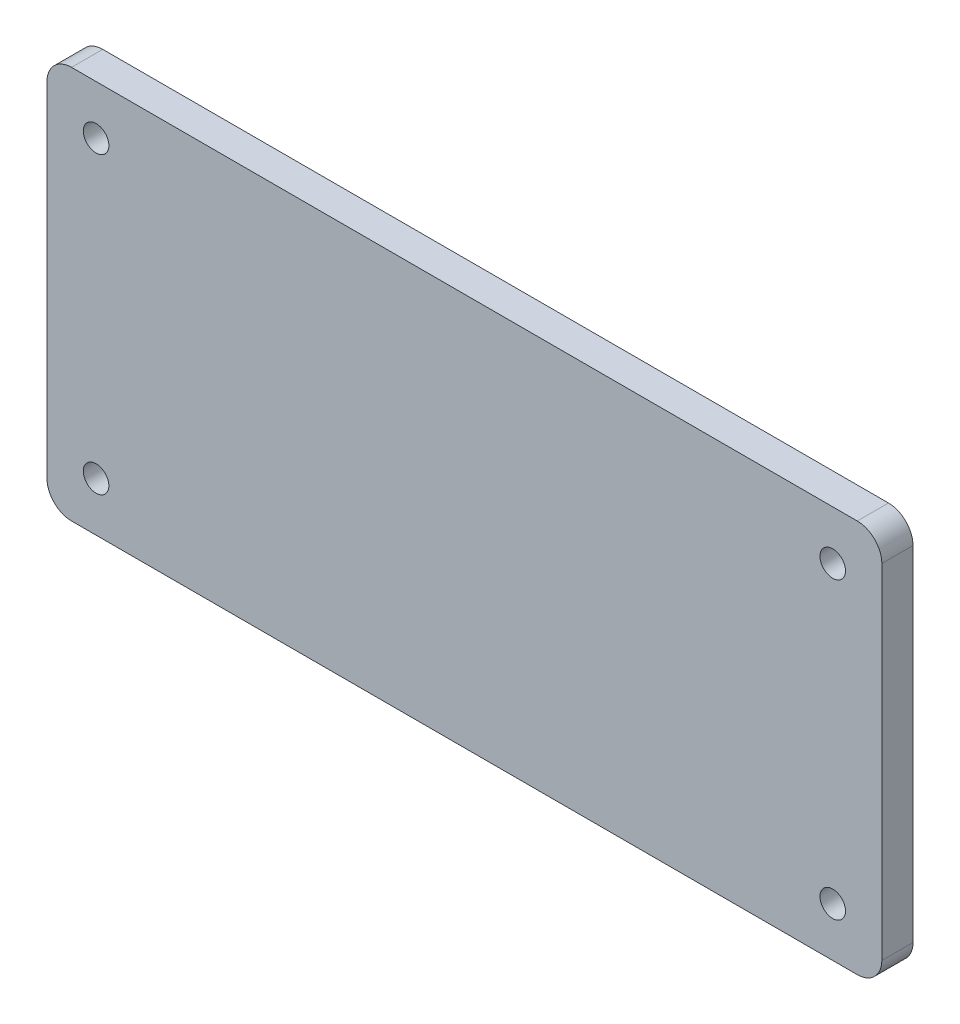
ISO-10303-21;
HEADER;
FILE_DESCRIPTION(('STEP AP214'),'2;1');
FILE_NAME('part.step','',(''),(''),'','','');
FILE_SCHEMA(('AUTOMOTIVE_DESIGN { 1 0 10303 214 1 1 1 1 }'));
ENDSEC;
DATA;
#1=APPLICATION_CONTEXT('core data for automotive mechanical design processes');
#2=APPLICATION_PROTOCOL_DEFINITION('international standard','automotive_design',2000,#1);
#3=PRODUCT_CONTEXT('',#1,'mechanical');
#4=PRODUCT('Part','Part','',(#3));
#5=PRODUCT_RELATED_PRODUCT_CATEGORY('part','',(#4));
#6=PRODUCT_DEFINITION_FORMATION('','',#4);
#7=PRODUCT_DEFINITION_CONTEXT('part definition',#1,'design');
#8=PRODUCT_DEFINITION('design','',#6,#7);
#9=PRODUCT_DEFINITION_SHAPE('','',#8);
#10=(LENGTH_UNIT() NAMED_UNIT(*) SI_UNIT(.MILLI.,.METRE.));
#11=(NAMED_UNIT(*) PLANE_ANGLE_UNIT() SI_UNIT($,.RADIAN.));
#12=(NAMED_UNIT(*) SI_UNIT($,.STERADIAN.) SOLID_ANGLE_UNIT());
#13=UNCERTAINTY_MEASURE_WITH_UNIT(LENGTH_MEASURE(1.E-05),#10,'distance_accuracy_value','');
#14=(GEOMETRIC_REPRESENTATION_CONTEXT(3) GLOBAL_UNCERTAINTY_ASSIGNED_CONTEXT((#13)) GLOBAL_UNIT_ASSIGNED_CONTEXT((#10,
#11,#12)) REPRESENTATION_CONTEXT('',''));
#15=CARTESIAN_POINT('',(0.,0.,0.));
#16=DIRECTION('',(0.,0.,1.));
#17=DIRECTION('',(1.,0.,0.));
#18=AXIS2_PLACEMENT_3D('',#15,#16,#17);
#19=CARTESIAN_POINT('',(80.,35.,6.35));
#20=DIRECTION('',(0.,0.,-1.));
#21=DIRECTION('',(-1.,0.,0.));
#22=AXIS2_PLACEMENT_3D('',#19,#20,#21);
#23=PLANE('',#22);
#24=CARTESIAN_POINT('',(75.,-30.,6.35));
#25=DIRECTION('',(0.,0.,1.));
#26=DIRECTION('',(1.,0.,0.));
#27=AXIS2_PLACEMENT_3D('',#24,#25,#26);
#28=CIRCLE('',#27,2.59999999999999);
#29=CARTESIAN_POINT('',(77.6,-30.,6.35));
#30=VERTEX_POINT('',#29);
#31=EDGE_CURVE('E156',#30,#30,#28,.T.);
#32=ORIENTED_EDGE('',*,*,#31,.F.);
#33=EDGE_LOOP('',(#32));
#34=FACE_BOUND('',#33,.T.);
#35=CARTESIAN_POINT('',(-75.,30.,6.35));
#36=DIRECTION('',(0.,0.,1.));
#37=DIRECTION('',(1.,0.,0.));
#38=AXIS2_PLACEMENT_3D('',#35,#36,#37);
#39=CIRCLE('',#38,2.59999999999999);
#40=CARTESIAN_POINT('',(-72.4,30.,6.35));
#41=VERTEX_POINT('',#40);
#42=EDGE_CURVE('E157',#41,#41,#39,.T.);
#43=ORIENTED_EDGE('',*,*,#42,.F.);
#44=EDGE_LOOP('',(#43));
#45=FACE_BOUND('',#44,.T.);
#46=CARTESIAN_POINT('',(80.,35.,6.35));
#47=DIRECTION('',(0.,0.,1.));
#48=DIRECTION('',(-1.,0.,0.));
#49=AXIS2_PLACEMENT_3D('',#46,#47,#48);
#50=CIRCLE('',#49,5.);
#51=CARTESIAN_POINT('',(85.,35.,6.35));
#52=VERTEX_POINT('',#51);
#53=CARTESIAN_POINT('',(80.,40.,6.35));
#54=VERTEX_POINT('',#53);
#55=EDGE_CURVE('E170',#52,#54,#50,.T.);
#56=ORIENTED_EDGE('',*,*,#55,.T.);
#57=DIRECTION('',(-1.,0.,0.));
#58=VECTOR('',#57,1.);
#59=CARTESIAN_POINT('',(80.,40.,6.35));
#60=LINE('',#59,#58);
#61=CARTESIAN_POINT('',(-80.,40.,6.35));
#62=VERTEX_POINT('',#61);
#63=EDGE_CURVE('E96',#54,#62,#60,.T.);
#64=ORIENTED_EDGE('',*,*,#63,.T.);
#65=CARTESIAN_POINT('',(-80.,35.,6.35));
#66=DIRECTION('',(0.,0.,1.));
#67=DIRECTION('',(-1.,0.,0.));
#68=AXIS2_PLACEMENT_3D('',#65,#66,#67);
#69=CIRCLE('',#68,5.);
#70=CARTESIAN_POINT('',(-85.,35.,6.35));
#71=VERTEX_POINT('',#70);
#72=EDGE_CURVE('E176',#62,#71,#69,.T.);
#73=ORIENTED_EDGE('',*,*,#72,.T.);
#74=DIRECTION('',(0.,-1.,0.));
#75=VECTOR('',#74,1.);
#76=CARTESIAN_POINT('',(-85.,-35.,6.35));
#77=LINE('',#76,#75);
#78=CARTESIAN_POINT('',(-85.,-35.,6.35));
#79=VERTEX_POINT('',#78);
#80=EDGE_CURVE('E180',#71,#79,#77,.T.);
#81=ORIENTED_EDGE('',*,*,#80,.T.);
#82=CARTESIAN_POINT('',(-80.,-35.,6.35));
#83=DIRECTION('',(0.,0.,1.));
#84=DIRECTION('',(-1.,0.,0.));
#85=AXIS2_PLACEMENT_3D('',#82,#83,#84);
#86=CIRCLE('',#85,5.);
#87=CARTESIAN_POINT('',(-80.,-40.,6.35));
#88=VERTEX_POINT('',#87);
#89=EDGE_CURVE('E115',#79,#88,#86,.T.);
#90=ORIENTED_EDGE('',*,*,#89,.T.);
#91=DIRECTION('',(1.,0.,0.));
#92=VECTOR('',#91,1.);
#93=CARTESIAN_POINT('',(80.,-40.,6.35));
#94=LINE('',#93,#92);
#95=CARTESIAN_POINT('',(80.,-40.,6.35));
#96=VERTEX_POINT('',#95);
#97=EDGE_CURVE('E109',#88,#96,#94,.T.);
#98=ORIENTED_EDGE('',*,*,#97,.T.);
#99=CARTESIAN_POINT('',(80.,-35.,6.35));
#100=DIRECTION('',(0.,0.,1.));
#101=DIRECTION('',(1.,0.,0.));
#102=AXIS2_PLACEMENT_3D('',#99,#100,#101);
#103=CIRCLE('',#102,5.);
#104=CARTESIAN_POINT('',(85.,-35.,6.35));
#105=VERTEX_POINT('',#104);
#106=EDGE_CURVE('E113',#96,#105,#103,.T.);
#107=ORIENTED_EDGE('',*,*,#106,.T.);
#108=DIRECTION('',(0.,1.,0.));
#109=VECTOR('',#108,1.);
#110=CARTESIAN_POINT('',(85.,-35.,6.35));
#111=LINE('',#110,#109);
#112=EDGE_CURVE('E53',#105,#52,#111,.T.);
#113=ORIENTED_EDGE('',*,*,#112,.T.);
#114=EDGE_LOOP('',(#56,#64,#73,#81,#90,#98,#107,#113));
#115=FACE_BOUND('',#114,.T.);
#116=CARTESIAN_POINT('',(75.,30.,6.35));
#117=DIRECTION('',(0.,0.,1.));
#118=DIRECTION('',(-1.,0.,0.));
#119=AXIS2_PLACEMENT_3D('',#116,#117,#118);
#120=CIRCLE('',#119,2.59999999999999);
#121=CARTESIAN_POINT('',(72.4,30.,6.35));
#122=VERTEX_POINT('',#121);
#123=EDGE_CURVE('E144',#122,#122,#120,.T.);
#124=ORIENTED_EDGE('',*,*,#123,.F.);
#125=EDGE_LOOP('',(#124));
#126=FACE_BOUND('',#125,.T.);
#127=CARTESIAN_POINT('',(-75.,-30.,6.35));
#128=DIRECTION('',(0.,0.,1.));
#129=DIRECTION('',(-1.,0.,0.));
#130=AXIS2_PLACEMENT_3D('',#127,#128,#129);
#131=CIRCLE('',#130,2.59999999999999);
#132=CARTESIAN_POINT('',(-77.6,-30.,6.35));
#133=VERTEX_POINT('',#132);
#134=EDGE_CURVE('E355',#133,#133,#131,.T.);
#135=ORIENTED_EDGE('',*,*,#134,.F.);
#136=EDGE_LOOP('',(#135));
#137=FACE_BOUND('',#136,.T.);
#138=ADVANCED_FACE('F36',(#34,#45,#115,#126,#137),#23,.F.);
#139=CARTESIAN_POINT('',(80.,35.,0.));
#140=DIRECTION('',(0.,0.,-1.));
#141=DIRECTION('',(-1.,0.,0.));
#142=AXIS2_PLACEMENT_3D('',#139,#140,#141);
#143=PLANE('',#142);
#144=CARTESIAN_POINT('',(75.,-30.,0.));
#145=DIRECTION('',(0.,0.,1.));
#146=DIRECTION('',(1.,0.,0.));
#147=AXIS2_PLACEMENT_3D('',#144,#145,#146);
#148=CIRCLE('',#147,2.59999999999999);
#149=CARTESIAN_POINT('',(77.6,-30.,0.));
#150=VERTEX_POINT('',#149);
#151=EDGE_CURVE('E152',#150,#150,#148,.T.);
#152=ORIENTED_EDGE('',*,*,#151,.T.);
#153=EDGE_LOOP('',(#152));
#154=FACE_BOUND('',#153,.T.);
#155=CARTESIAN_POINT('',(-75.,30.,0.));
#156=DIRECTION('',(0.,0.,1.));
#157=DIRECTION('',(1.,0.,0.));
#158=AXIS2_PLACEMENT_3D('',#155,#156,#157);
#159=CIRCLE('',#158,2.59999999999999);
#160=CARTESIAN_POINT('',(-72.4,30.,0.));
#161=VERTEX_POINT('',#160);
#162=EDGE_CURVE('E150',#161,#161,#159,.T.);
#163=ORIENTED_EDGE('',*,*,#162,.T.);
#164=EDGE_LOOP('',(#163));
#165=FACE_BOUND('',#164,.T.);
#166=CARTESIAN_POINT('',(80.,35.,0.));
#167=DIRECTION('',(0.,0.,1.));
#168=DIRECTION('',(-1.,0.,0.));
#169=AXIS2_PLACEMENT_3D('',#166,#167,#168);
#170=CIRCLE('',#169,5.);
#171=CARTESIAN_POINT('',(85.,35.,0.));
#172=VERTEX_POINT('',#171);
#173=CARTESIAN_POINT('',(80.,40.,0.));
#174=VERTEX_POINT('',#173);
#175=EDGE_CURVE('E162',#172,#174,#170,.T.);
#176=ORIENTED_EDGE('',*,*,#175,.F.);
#177=DIRECTION('',(0.,1.,0.));
#178=VECTOR('',#177,1.);
#179=CARTESIAN_POINT('',(85.,-35.,0.));
#180=LINE('',#179,#178);
#181=CARTESIAN_POINT('',(85.,-35.,0.));
#182=VERTEX_POINT('',#181);
#183=EDGE_CURVE('E88',#182,#172,#180,.T.);
#184=ORIENTED_EDGE('',*,*,#183,.F.);
#185=CARTESIAN_POINT('',(80.,-35.,0.));
#186=DIRECTION('',(0.,0.,1.));
#187=DIRECTION('',(1.,0.,0.));
#188=AXIS2_PLACEMENT_3D('',#185,#186,#187);
#189=CIRCLE('',#188,5.);
#190=CARTESIAN_POINT('',(80.,-40.,0.));
#191=VERTEX_POINT('',#190);
#192=EDGE_CURVE('E82',#191,#182,#189,.T.);
#193=ORIENTED_EDGE('',*,*,#192,.F.);
#194=DIRECTION('',(1.,0.,0.));
#195=VECTOR('',#194,1.);
#196=CARTESIAN_POINT('',(80.,-40.,0.));
#197=LINE('',#196,#195);
#198=CARTESIAN_POINT('',(-80.,-40.,0.));
#199=VERTEX_POINT('',#198);
#200=EDGE_CURVE('E124',#199,#191,#197,.T.);
#201=ORIENTED_EDGE('',*,*,#200,.F.);
#202=CARTESIAN_POINT('',(-80.,-35.,0.));
#203=DIRECTION('',(0.,0.,1.));
#204=DIRECTION('',(-1.,0.,0.));
#205=AXIS2_PLACEMENT_3D('',#202,#203,#204);
#206=CIRCLE('',#205,5.);
#207=CARTESIAN_POINT('',(-85.,-35.,0.));
#208=VERTEX_POINT('',#207);
#209=EDGE_CURVE('E202',#208,#199,#206,.T.);
#210=ORIENTED_EDGE('',*,*,#209,.F.);
#211=DIRECTION('',(0.,-1.,0.));
#212=VECTOR('',#211,1.);
#213=CARTESIAN_POINT('',(-85.,-35.,0.));
#214=LINE('',#213,#212);
#215=CARTESIAN_POINT('',(-85.,35.,0.));
#216=VERTEX_POINT('',#215);
#217=EDGE_CURVE('E196',#216,#208,#214,.T.);
#218=ORIENTED_EDGE('',*,*,#217,.F.);
#219=CARTESIAN_POINT('',(-80.,35.,0.));
#220=DIRECTION('',(0.,0.,1.));
#221=DIRECTION('',(-1.,0.,0.));
#222=AXIS2_PLACEMENT_3D('',#219,#220,#221);
#223=CIRCLE('',#222,5.);
#224=CARTESIAN_POINT('',(-80.,40.,0.));
#225=VERTEX_POINT('',#224);
#226=EDGE_CURVE('E210',#225,#216,#223,.T.);
#227=ORIENTED_EDGE('',*,*,#226,.F.);
#228=DIRECTION('',(-1.,0.,0.));
#229=VECTOR('',#228,1.);
#230=CARTESIAN_POINT('',(80.,40.,0.));
#231=LINE('',#230,#229);
#232=EDGE_CURVE('E215',#174,#225,#231,.T.);
#233=ORIENTED_EDGE('',*,*,#232,.F.);
#234=EDGE_LOOP('',(#176,#184,#193,#201,#210,#218,#227,#233));
#235=FACE_BOUND('',#234,.T.);
#236=CARTESIAN_POINT('',(75.,30.,0.));
#237=DIRECTION('',(0.,0.,1.));
#238=DIRECTION('',(-1.,0.,0.));
#239=AXIS2_PLACEMENT_3D('',#236,#237,#238);
#240=CIRCLE('',#239,2.59999999999999);
#241=CARTESIAN_POINT('',(72.4,30.,0.));
#242=VERTEX_POINT('',#241);
#243=EDGE_CURVE('E151',#242,#242,#240,.T.);
#244=ORIENTED_EDGE('',*,*,#243,.T.);
#245=EDGE_LOOP('',(#244));
#246=FACE_BOUND('',#245,.T.);
#247=CARTESIAN_POINT('',(-75.,-30.,0.));
#248=DIRECTION('',(0.,0.,1.));
#249=DIRECTION('',(-1.,0.,0.));
#250=AXIS2_PLACEMENT_3D('',#247,#248,#249);
#251=CIRCLE('',#250,2.59999999999999);
#252=CARTESIAN_POINT('',(-77.6,-30.,0.));
#253=VERTEX_POINT('',#252);
#254=EDGE_CURVE('E358',#253,#253,#251,.T.);
#255=ORIENTED_EDGE('',*,*,#254,.T.);
#256=EDGE_LOOP('',(#255));
#257=FACE_BOUND('',#256,.T.);
#258=ADVANCED_FACE('F213',(#154,#165,#235,#246,#257),#143,.T.);
#259=CARTESIAN_POINT('',(80.,35.,6.35));
#260=DIRECTION('',(0.,0.,-1.));
#261=DIRECTION('',(-1.,0.,0.));
#262=AXIS2_PLACEMENT_3D('',#259,#260,#261);
#263=CYLINDRICAL_SURFACE('',#262,5.);
#264=ORIENTED_EDGE('',*,*,#175,.T.);
#265=DIRECTION('',(0.,0.,-1.));
#266=VECTOR('',#265,1.);
#267=CARTESIAN_POINT('',(80.,40.,6.35));
#268=LINE('',#267,#266);
#269=EDGE_CURVE('E12',#54,#174,#268,.T.);
#270=ORIENTED_EDGE('',*,*,#269,.F.);
#271=ORIENTED_EDGE('',*,*,#55,.F.);
#272=DIRECTION('',(0.,0.,-1.));
#273=VECTOR('',#272,1.);
#274=CARTESIAN_POINT('',(85.,35.,6.35));
#275=LINE('',#274,#273);
#276=EDGE_CURVE('E132',#52,#172,#275,.T.);
#277=ORIENTED_EDGE('',*,*,#276,.T.);
#278=EDGE_LOOP('',(#264,#270,#271,#277));
#279=FACE_BOUND('',#278,.T.);
#280=ADVANCED_FACE('F38',(#279),#263,.T.);
#281=CARTESIAN_POINT('',(80.,40.,6.35));
#282=DIRECTION('',(0.,-1.,0.));
#283=DIRECTION('',(1.,0.,0.));
#284=AXIS2_PLACEMENT_3D('',#281,#282,#283);
#285=PLANE('',#284);
#286=ORIENTED_EDGE('',*,*,#232,.T.);
#287=DIRECTION('',(0.,0.,-1.));
#288=VECTOR('',#287,1.);
#289=CARTESIAN_POINT('',(-80.,40.,6.35));
#290=LINE('',#289,#288);
#291=EDGE_CURVE('E45',#62,#225,#290,.T.);
#292=ORIENTED_EDGE('',*,*,#291,.F.);
#293=ORIENTED_EDGE('',*,*,#63,.F.);
#294=ORIENTED_EDGE('',*,*,#269,.T.);
#295=EDGE_LOOP('',(#286,#292,#293,#294));
#296=FACE_BOUND('',#295,.T.);
#297=ADVANCED_FACE('F229',(#296),#285,.F.);
#298=CARTESIAN_POINT('',(-80.,35.,6.35));
#299=DIRECTION('',(0.,0.,-1.));
#300=DIRECTION('',(-1.,0.,0.));
#301=AXIS2_PLACEMENT_3D('',#298,#299,#300);
#302=CYLINDRICAL_SURFACE('',#301,5.);
#303=ORIENTED_EDGE('',*,*,#226,.T.);
#304=DIRECTION('',(0.,0.,-1.));
#305=VECTOR('',#304,1.);
#306=CARTESIAN_POINT('',(-85.,35.,6.35));
#307=LINE('',#306,#305);
#308=EDGE_CURVE('E199',#71,#216,#307,.T.);
#309=ORIENTED_EDGE('',*,*,#308,.F.);
#310=ORIENTED_EDGE('',*,*,#72,.F.);
#311=ORIENTED_EDGE('',*,*,#291,.T.);
#312=EDGE_LOOP('',(#303,#309,#310,#311));
#313=FACE_BOUND('',#312,.T.);
#314=ADVANCED_FACE('F209',(#313),#302,.T.);
#315=CARTESIAN_POINT('',(-85.,-35.,6.35));
#316=DIRECTION('',(1.,0.,0.));
#317=DIRECTION('',(0.,0.,-1.));
#318=AXIS2_PLACEMENT_3D('',#315,#316,#317);
#319=PLANE('',#318);
#320=ORIENTED_EDGE('',*,*,#217,.T.);
#321=DIRECTION('',(0.,0.,-1.));
#322=VECTOR('',#321,1.);
#323=CARTESIAN_POINT('',(-85.,-35.,6.35));
#324=LINE('',#323,#322);
#325=EDGE_CURVE('E193',#79,#208,#324,.T.);
#326=ORIENTED_EDGE('',*,*,#325,.F.);
#327=ORIENTED_EDGE('',*,*,#80,.F.);
#328=ORIENTED_EDGE('',*,*,#308,.T.);
#329=EDGE_LOOP('',(#320,#326,#327,#328));
#330=FACE_BOUND('',#329,.T.);
#331=ADVANCED_FACE('F194',(#330),#319,.F.);
#332=CARTESIAN_POINT('',(-80.,-35.,6.35));
#333=DIRECTION('',(0.,0.,-1.));
#334=DIRECTION('',(-1.,0.,0.));
#335=AXIS2_PLACEMENT_3D('',#332,#333,#334);
#336=CYLINDRICAL_SURFACE('',#335,5.);
#337=ORIENTED_EDGE('',*,*,#209,.T.);
#338=DIRECTION('',(0.,0.,-1.));
#339=VECTOR('',#338,1.);
#340=CARTESIAN_POINT('',(-80.,-40.,6.35));
#341=LINE('',#340,#339);
#342=EDGE_CURVE('E125',#88,#199,#341,.T.);
#343=ORIENTED_EDGE('',*,*,#342,.F.);
#344=ORIENTED_EDGE('',*,*,#89,.F.);
#345=ORIENTED_EDGE('',*,*,#325,.T.);
#346=EDGE_LOOP('',(#337,#343,#344,#345));
#347=FACE_BOUND('',#346,.T.);
#348=ADVANCED_FACE('F201',(#347),#336,.T.);
#349=CARTESIAN_POINT('',(80.,-40.,6.35));
#350=DIRECTION('',(0.,1.,0.));
#351=DIRECTION('',(-1.,0.,0.));
#352=AXIS2_PLACEMENT_3D('',#349,#350,#351);
#353=PLANE('',#352);
#354=ORIENTED_EDGE('',*,*,#200,.T.);
#355=DIRECTION('',(0.,0.,-1.));
#356=VECTOR('',#355,1.);
#357=CARTESIAN_POINT('',(80.,-40.,6.35));
#358=LINE('',#357,#356);
#359=EDGE_CURVE('E121',#96,#191,#358,.T.);
#360=ORIENTED_EDGE('',*,*,#359,.F.);
#361=ORIENTED_EDGE('',*,*,#97,.F.);
#362=ORIENTED_EDGE('',*,*,#342,.T.);
#363=EDGE_LOOP('',(#354,#360,#361,#362));
#364=FACE_BOUND('',#363,.T.);
#365=ADVANCED_FACE('F122',(#364),#353,.F.);
#366=CARTESIAN_POINT('',(80.,-35.,6.35));
#367=DIRECTION('',(0.,0.,-1.));
#368=DIRECTION('',(-1.,0.,0.));
#369=AXIS2_PLACEMENT_3D('',#366,#367,#368);
#370=CYLINDRICAL_SURFACE('',#369,5.);
#371=ORIENTED_EDGE('',*,*,#192,.T.);
#372=DIRECTION('',(0.,0.,-1.));
#373=VECTOR('',#372,1.);
#374=CARTESIAN_POINT('',(85.,-35.,6.35));
#375=LINE('',#374,#373);
#376=EDGE_CURVE('E126',#105,#182,#375,.T.);
#377=ORIENTED_EDGE('',*,*,#376,.F.);
#378=ORIENTED_EDGE('',*,*,#106,.F.);
#379=ORIENTED_EDGE('',*,*,#359,.T.);
#380=EDGE_LOOP('',(#371,#377,#378,#379));
#381=FACE_BOUND('',#380,.T.);
#382=ADVANCED_FACE('F128',(#381),#370,.T.);
#383=CARTESIAN_POINT('',(85.,-35.,6.35));
#384=DIRECTION('',(-1.,0.,0.));
#385=DIRECTION('',(0.,-1.,0.));
#386=AXIS2_PLACEMENT_3D('',#383,#384,#385);
#387=PLANE('',#386);
#388=ORIENTED_EDGE('',*,*,#183,.T.);
#389=ORIENTED_EDGE('',*,*,#276,.F.);
#390=ORIENTED_EDGE('',*,*,#112,.F.);
#391=ORIENTED_EDGE('',*,*,#376,.T.);
#392=EDGE_LOOP('',(#388,#389,#390,#391));
#393=FACE_BOUND('',#392,.T.);
#394=ADVANCED_FACE('F224',(#393),#387,.F.);
#395=CARTESIAN_POINT('',(-75.,30.,6.35));
#396=DIRECTION('',(0.,0.,-1.));
#397=DIRECTION('',(-1.,0.,0.));
#398=AXIS2_PLACEMENT_3D('',#395,#396,#397);
#399=CYLINDRICAL_SURFACE('',#398,2.59999999999999);
#400=ORIENTED_EDGE('',*,*,#42,.T.);
#401=EDGE_LOOP('',(#400));
#402=FACE_BOUND('',#401,.T.);
#403=ORIENTED_EDGE('',*,*,#162,.F.);
#404=EDGE_LOOP('',(#403));
#405=FACE_BOUND('',#404,.T.);
#406=ADVANCED_FACE('F247',(#402,#405),#399,.F.);
#407=CARTESIAN_POINT('',(75.,30.,6.35));
#408=DIRECTION('',(0.,0.,-1.));
#409=DIRECTION('',(-1.,0.,0.));
#410=AXIS2_PLACEMENT_3D('',#407,#408,#409);
#411=CYLINDRICAL_SURFACE('',#410,2.59999999999999);
#412=ORIENTED_EDGE('',*,*,#123,.T.);
#413=EDGE_LOOP('',(#412));
#414=FACE_BOUND('',#413,.T.);
#415=ORIENTED_EDGE('',*,*,#243,.F.);
#416=EDGE_LOOP('',(#415));
#417=FACE_BOUND('',#416,.T.);
#418=ADVANCED_FACE('F285',(#414,#417),#411,.F.);
#419=CARTESIAN_POINT('',(75.,-30.,6.35));
#420=DIRECTION('',(0.,0.,-1.));
#421=DIRECTION('',(-1.,0.,0.));
#422=AXIS2_PLACEMENT_3D('',#419,#420,#421);
#423=CYLINDRICAL_SURFACE('',#422,2.59999999999999);
#424=ORIENTED_EDGE('',*,*,#31,.T.);
#425=EDGE_LOOP('',(#424));
#426=FACE_BOUND('',#425,.T.);
#427=ORIENTED_EDGE('',*,*,#151,.F.);
#428=EDGE_LOOP('',(#427));
#429=FACE_BOUND('',#428,.T.);
#430=ADVANCED_FACE('F292',(#426,#429),#423,.F.);
#431=CARTESIAN_POINT('',(-75.,-30.,6.35));
#432=DIRECTION('',(0.,0.,-1.));
#433=DIRECTION('',(-1.,0.,0.));
#434=AXIS2_PLACEMENT_3D('',#431,#432,#433);
#435=CYLINDRICAL_SURFACE('',#434,2.59999999999999);
#436=ORIENTED_EDGE('',*,*,#134,.T.);
#437=EDGE_LOOP('',(#436));
#438=FACE_BOUND('',#437,.T.);
#439=ORIENTED_EDGE('',*,*,#254,.F.);
#440=EDGE_LOOP('',(#439));
#441=FACE_BOUND('',#440,.T.);
#442=ADVANCED_FACE('F299',(#438,#441),#435,.F.);
#443=CLOSED_SHELL('',(#138,#258,#280,#297,#314,#331,#348,#365,#382,#394,#406,#418,#430,#442));
#444=MANIFOLD_SOLID_BREP('B2',#443);
#445=ADVANCED_BREP_SHAPE_REPRESENTATION('',(#18,#444),#14);
#446=SHAPE_DEFINITION_REPRESENTATION(#9,#445);
ENDSEC;
END-ISO-10303-21;
